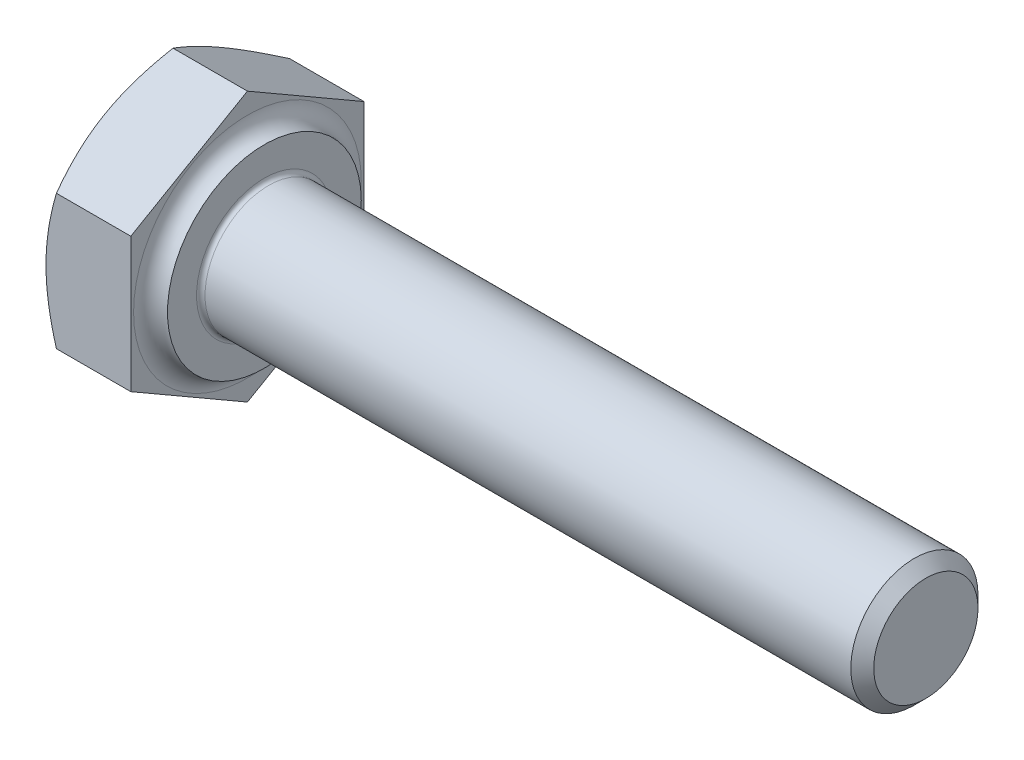
ISO-10303-21;
HEADER;
FILE_DESCRIPTION(('STEP AP214'),'2;1');
FILE_NAME('part.step','',(''),(''),'','','');
FILE_SCHEMA(('AUTOMOTIVE_DESIGN { 1 0 10303 214 1 1 1 1 }'));
ENDSEC;
DATA;
#1=APPLICATION_CONTEXT('core data for automotive mechanical design processes');
#2=APPLICATION_PROTOCOL_DEFINITION('international standard','automotive_design',2000,#1);
#3=PRODUCT_CONTEXT('',#1,'mechanical');
#4=PRODUCT('Part','Part','',(#3));
#5=PRODUCT_RELATED_PRODUCT_CATEGORY('part','',(#4));
#6=PRODUCT_DEFINITION_FORMATION('','',#4);
#7=PRODUCT_DEFINITION_CONTEXT('part definition',#1,'design');
#8=PRODUCT_DEFINITION('design','',#6,#7);
#9=PRODUCT_DEFINITION_SHAPE('','',#8);
#10=(LENGTH_UNIT() NAMED_UNIT(*) SI_UNIT(.MILLI.,.METRE.));
#11=(NAMED_UNIT(*) PLANE_ANGLE_UNIT() SI_UNIT($,.RADIAN.));
#12=(NAMED_UNIT(*) SI_UNIT($,.STERADIAN.) SOLID_ANGLE_UNIT());
#13=UNCERTAINTY_MEASURE_WITH_UNIT(LENGTH_MEASURE(1.E-05),#10,'distance_accuracy_value','');
#14=(GEOMETRIC_REPRESENTATION_CONTEXT(3) GLOBAL_UNCERTAINTY_ASSIGNED_CONTEXT((#13)) GLOBAL_UNIT_ASSIGNED_CONTEXT((#10,
#11,#12)) REPRESENTATION_CONTEXT('',''));
#15=CARTESIAN_POINT('',(0.,0.,0.));
#16=DIRECTION('',(0.,0.,1.));
#17=DIRECTION('',(1.,0.,0.));
#18=AXIS2_PLACEMENT_3D('',#15,#16,#17);
#19=CARTESIAN_POINT('',(-2.4,2.38156986040721,1.375));
#20=DIRECTION('',(0.,0.866025403784439,0.5));
#21=DIRECTION('',(0.,-0.5,0.866025403784439));
#22=AXIS2_PLACEMENT_3D('',#19,#20,#21);
#23=PLANE('',#22);
#24=CARTESIAN_POINT('',(-1.75390444775792,1.58689004084149,2.75142582323749));
#25=CARTESIAN_POINT('',(-2.,2.01280892325375,2.01371267899652));
#26=CARTESIAN_POINT('',(-2.,2.38156986040721,1.375));
#27=CARTESIAN_POINT('',(-2.,2.75033079756067,0.736287321003486));
#28=CARTESIAN_POINT('',(-1.75390444775792,3.17624967997292,-0.0014258232374917));
#29=(BOUNDED_CURVE() B_SPLINE_CURVE(2,(#24,#25,#26,#27,#28),.UNSPECIFIED.,.F.,
.F.) B_SPLINE_CURVE_WITH_KNOTS((3,2,3),(0.,1.6124120093164,3.22482401863281),
.UNSPECIFIED.) CURVE() GEOMETRIC_REPRESENTATION_ITEM() RATIONAL_B_SPLINE_CURVE((1.,
1.03802697460133,1.,1.03802697460134,1.)) REPRESENTATION_ITEM(''));
#30=CARTESIAN_POINT('',(-1.75437990693804,1.58771324027147,2.75));
#31=VERTEX_POINT('',#30);
#32=CARTESIAN_POINT('',(-2.,2.38156986040721,1.375));
#33=VERTEX_POINT('',#32);
#34=EDGE_CURVE('E154',#31,#33,#29,.T.);
#35=ORIENTED_EDGE('',*,*,#34,.F.);
#36=DIRECTION('',(-1.,0.,0.));
#37=VECTOR('',#36,1.);
#38=CARTESIAN_POINT('',(0.,1.58771324027147,2.75));
#39=LINE('',#38,#37);
#40=CARTESIAN_POINT('',(0.,1.58771324027147,2.75));
#41=VERTEX_POINT('',#40);
#42=EDGE_CURVE('E457',#41,#31,#39,.T.);
#43=ORIENTED_EDGE('',*,*,#42,.F.);
#44=DIRECTION('',(0.,-0.5,0.866025403784439));
#45=VECTOR('',#44,1.);
#46=CARTESIAN_POINT('',(0.,1.58771324027147,2.75));
#47=LINE('',#46,#45);
#48=CARTESIAN_POINT('',(0.,3.17542648054294,0.));
#49=VERTEX_POINT('',#48);
#50=EDGE_CURVE('E466',#49,#41,#47,.T.);
#51=ORIENTED_EDGE('',*,*,#50,.F.);
#52=DIRECTION('',(-1.,0.,0.));
#53=VECTOR('',#52,1.);
#54=CARTESIAN_POINT('',(0.,3.17542648054294,0.));
#55=LINE('',#54,#53);
#56=CARTESIAN_POINT('',(-1.75437990693804,3.17542648054294,0.));
#57=VERTEX_POINT('',#56);
#58=EDGE_CURVE('E303',#49,#57,#55,.T.);
#59=ORIENTED_EDGE('',*,*,#58,.T.);
#60=CARTESIAN_POINT('',(-1.75390444775792,1.58689004084149,2.75142582323749));
#61=CARTESIAN_POINT('',(-2.,2.01280892325375,2.01371267899652));
#62=CARTESIAN_POINT('',(-2.,2.38156986040721,1.375));
#63=CARTESIAN_POINT('',(-2.,2.75033079756067,0.736287321003486));
#64=CARTESIAN_POINT('',(-1.75390444775792,3.17624967997292,-0.0014258232374917));
#65=(BOUNDED_CURVE() B_SPLINE_CURVE(2,(#60,#61,#62,#63,#64),.UNSPECIFIED.,.F.,
.F.) B_SPLINE_CURVE_WITH_KNOTS((3,2,3),(0.,1.6124120093164,3.22482401863281),
.UNSPECIFIED.) CURVE() GEOMETRIC_REPRESENTATION_ITEM() RATIONAL_B_SPLINE_CURVE((1.,
1.03802697460133,1.,1.03802697460134,1.)) REPRESENTATION_ITEM(''));
#66=EDGE_CURVE('E103',#33,#57,#65,.T.);
#67=ORIENTED_EDGE('',*,*,#66,.F.);
#68=EDGE_LOOP('',(#35,#43,#51,#59,#67));
#69=FACE_BOUND('',#68,.T.);
#70=ADVANCED_FACE('F44',(#69),#23,.T.);
#71=CARTESIAN_POINT('',(-2.4,0.,2.75));
#72=DIRECTION('',(0.,0.,1.));
#73=DIRECTION('',(0.,-1.,0.));
#74=AXIS2_PLACEMENT_3D('',#71,#72,#73);
#75=PLANE('',#74);
#76=CARTESIAN_POINT('',(-1.75390444775792,-1.58935963913144,2.75));
#77=CARTESIAN_POINT('',(-2.,-0.737521874306931,2.75));
#78=CARTESIAN_POINT('',(-2.,0.,2.75));
#79=CARTESIAN_POINT('',(-2.,0.737521874306933,2.75));
#80=CARTESIAN_POINT('',(-1.75390444775792,1.58935963913144,2.75));
#81=(BOUNDED_CURVE() B_SPLINE_CURVE(2,(#76,#77,#78,#79,#80),.UNSPECIFIED.,.F.,
.F.) B_SPLINE_CURVE_WITH_KNOTS((3,2,3),(0.,1.6124120093164,3.22482401863281),
.UNSPECIFIED.) CURVE() GEOMETRIC_REPRESENTATION_ITEM() RATIONAL_B_SPLINE_CURVE((1.,
1.03802697460134,1.,1.03802697460135,1.)) REPRESENTATION_ITEM(''));
#82=CARTESIAN_POINT('',(-1.75437990693804,-1.58771324027147,2.75));
#83=VERTEX_POINT('',#82);
#84=CARTESIAN_POINT('',(-2.,0.,2.75));
#85=VERTEX_POINT('',#84);
#86=EDGE_CURVE('E137',#83,#85,#81,.T.);
#87=ORIENTED_EDGE('',*,*,#86,.F.);
#88=DIRECTION('',(-1.,0.,0.));
#89=VECTOR('',#88,1.);
#90=CARTESIAN_POINT('',(0.,-1.58771324027147,2.75));
#91=LINE('',#90,#89);
#92=CARTESIAN_POINT('',(0.,-1.58771324027147,2.75));
#93=VERTEX_POINT('',#92);
#94=EDGE_CURVE('E454',#93,#83,#91,.T.);
#95=ORIENTED_EDGE('',*,*,#94,.F.);
#96=DIRECTION('',(0.,-1.,0.));
#97=VECTOR('',#96,1.);
#98=CARTESIAN_POINT('',(0.,-1.58771324027147,2.75));
#99=LINE('',#98,#97);
#100=EDGE_CURVE('E459',#41,#93,#99,.T.);
#101=ORIENTED_EDGE('',*,*,#100,.F.);
#102=ORIENTED_EDGE('',*,*,#42,.T.);
#103=CARTESIAN_POINT('',(-1.75390444775792,-1.58935963913144,2.75));
#104=CARTESIAN_POINT('',(-2.,-0.737521874306931,2.75));
#105=CARTESIAN_POINT('',(-2.,0.,2.75));
#106=CARTESIAN_POINT('',(-2.,0.737521874306933,2.75));
#107=CARTESIAN_POINT('',(-1.75390444775792,1.58935963913144,2.75));
#108=(BOUNDED_CURVE() B_SPLINE_CURVE(2,(#103,#104,#105,#106,#107),.UNSPECIFIED.,.F.,
.F.) B_SPLINE_CURVE_WITH_KNOTS((3,2,3),(0.,1.6124120093164,3.22482401863281),
.UNSPECIFIED.) CURVE() GEOMETRIC_REPRESENTATION_ITEM() RATIONAL_B_SPLINE_CURVE((1.,
1.03802697460134,1.,1.03802697460135,1.)) REPRESENTATION_ITEM(''));
#109=EDGE_CURVE('E116',#85,#31,#108,.T.);
#110=ORIENTED_EDGE('',*,*,#109,.F.);
#111=EDGE_LOOP('',(#87,#95,#101,#102,#110));
#112=FACE_BOUND('',#111,.T.);
#113=ADVANCED_FACE('F210',(#112),#75,.T.);
#114=CARTESIAN_POINT('',(-2.4,-2.38156986040721,1.375));
#115=DIRECTION('',(0.,-0.866025403784439,0.5));
#116=DIRECTION('',(0.,-0.5,-0.866025403784439));
#117=AXIS2_PLACEMENT_3D('',#114,#115,#116);
#118=PLANE('',#117);
#119=CARTESIAN_POINT('',(-1.75390444775792,-3.17624967997292,-0.00142582323749051));
#120=CARTESIAN_POINT('',(-2.,-2.75033079756068,0.736287321003484));
#121=CARTESIAN_POINT('',(-2.,-2.38156986040721,1.375));
#122=CARTESIAN_POINT('',(-2.,-2.01280892325374,2.01371267899651));
#123=CARTESIAN_POINT('',(-1.75390444775792,-1.58689004084149,2.75142582323749));
#124=(BOUNDED_CURVE() B_SPLINE_CURVE(2,(#119,#120,#121,#122,#123),.UNSPECIFIED.,.F.,
.F.) B_SPLINE_CURVE_WITH_KNOTS((3,2,3),(0.,1.6124120093164,3.22482401863281),
.UNSPECIFIED.) CURVE() GEOMETRIC_REPRESENTATION_ITEM() RATIONAL_B_SPLINE_CURVE((1.,
1.03802697460134,1.,1.03802697460134,1.)) REPRESENTATION_ITEM(''));
#125=CARTESIAN_POINT('',(-1.75437990693813,-3.17542648054294,0.));
#126=VERTEX_POINT('',#125);
#127=CARTESIAN_POINT('',(-2.,-2.38156986040721,1.375));
#128=VERTEX_POINT('',#127);
#129=EDGE_CURVE('E178',#126,#128,#124,.T.);
#130=ORIENTED_EDGE('',*,*,#129,.F.);
#131=DIRECTION('',(-1.,0.,0.));
#132=VECTOR('',#131,1.);
#133=CARTESIAN_POINT('',(0.,-3.17542648054294,0.));
#134=LINE('',#133,#132);
#135=CARTESIAN_POINT('',(0.,-3.17542648054294,0.));
#136=VERTEX_POINT('',#135);
#137=EDGE_CURVE('E453',#136,#126,#134,.T.);
#138=ORIENTED_EDGE('',*,*,#137,.F.);
#139=DIRECTION('',(0.,-0.5,-0.866025403784439));
#140=VECTOR('',#139,1.);
#141=CARTESIAN_POINT('',(0.,-3.17542648054294,0.));
#142=LINE('',#141,#140);
#143=EDGE_CURVE('E294',#93,#136,#142,.T.);
#144=ORIENTED_EDGE('',*,*,#143,.F.);
#145=ORIENTED_EDGE('',*,*,#94,.T.);
#146=CARTESIAN_POINT('',(-1.75390444775792,-3.17624967997292,-0.00142582323749051));
#147=CARTESIAN_POINT('',(-2.,-2.75033079756068,0.736287321003484));
#148=CARTESIAN_POINT('',(-2.,-2.38156986040721,1.375));
#149=CARTESIAN_POINT('',(-2.,-2.01280892325374,2.01371267899651));
#150=CARTESIAN_POINT('',(-1.75390444775792,-1.58689004084149,2.75142582323749));
#151=(BOUNDED_CURVE() B_SPLINE_CURVE(2,(#146,#147,#148,#149,#150),.UNSPECIFIED.,.F.,
.F.) B_SPLINE_CURVE_WITH_KNOTS((3,2,3),(0.,1.6124120093164,3.22482401863281),
.UNSPECIFIED.) CURVE() GEOMETRIC_REPRESENTATION_ITEM() RATIONAL_B_SPLINE_CURVE((1.,
1.03802697460134,1.,1.03802697460134,1.)) REPRESENTATION_ITEM(''));
#152=EDGE_CURVE('E331',#128,#83,#151,.T.);
#153=ORIENTED_EDGE('',*,*,#152,.F.);
#154=EDGE_LOOP('',(#130,#138,#144,#145,#153));
#155=FACE_BOUND('',#154,.T.);
#156=ADVANCED_FACE('F216',(#155),#118,.T.);
#157=CARTESIAN_POINT('',(-2.4,2.38156986040721,-1.375));
#158=DIRECTION('',(0.,0.866025403784439,-0.5));
#159=DIRECTION('',(0.,0.5,0.866025403784439));
#160=AXIS2_PLACEMENT_3D('',#157,#158,#159);
#161=PLANE('',#160);
#162=CARTESIAN_POINT('',(-1.75390444775792,3.17624967997292,0.00142582323748956));
#163=CARTESIAN_POINT('',(-2.,2.75033079756067,-0.736287321003486));
#164=CARTESIAN_POINT('',(-2.,2.38156986040721,-1.375));
#165=CARTESIAN_POINT('',(-2.,2.01280892325374,-2.01371267899651));
#166=CARTESIAN_POINT('',(-1.75390444775792,1.58689004084149,-2.75142582323749));
#167=(BOUNDED_CURVE() B_SPLINE_CURVE(2,(#162,#163,#164,#165,#166),.UNSPECIFIED.,.F.,
.F.) B_SPLINE_CURVE_WITH_KNOTS((3,2,3),(0.,1.6124120093164,3.22482401863281),
.UNSPECIFIED.) CURVE() GEOMETRIC_REPRESENTATION_ITEM() RATIONAL_B_SPLINE_CURVE((1.,
1.03802697460134,1.,1.03802697460134,1.)) REPRESENTATION_ITEM(''));
#168=CARTESIAN_POINT('',(-2.,2.38156986040721,-1.375));
#169=VERTEX_POINT('',#168);
#170=EDGE_CURVE('E93',#57,#169,#167,.T.);
#171=ORIENTED_EDGE('',*,*,#170,.F.);
#172=ORIENTED_EDGE('',*,*,#58,.F.);
#173=DIRECTION('',(0.,0.5,0.866025403784439));
#174=VECTOR('',#173,1.);
#175=CARTESIAN_POINT('',(0.,3.17542648054294,0.));
#176=LINE('',#175,#174);
#177=CARTESIAN_POINT('',(0.,1.58771324027147,-2.75));
#178=VERTEX_POINT('',#177);
#179=EDGE_CURVE('E288',#178,#49,#176,.T.);
#180=ORIENTED_EDGE('',*,*,#179,.F.);
#181=DIRECTION('',(-1.,0.,0.));
#182=VECTOR('',#181,1.);
#183=CARTESIAN_POINT('',(0.,1.58771324027147,-2.75));
#184=LINE('',#183,#182);
#185=CARTESIAN_POINT('',(-1.75437990693804,1.58771324027147,-2.75));
#186=VERTEX_POINT('',#185);
#187=EDGE_CURVE('E98',#178,#186,#184,.T.);
#188=ORIENTED_EDGE('',*,*,#187,.T.);
#189=CARTESIAN_POINT('',(-1.75390444775792,3.17624967997292,0.00142582323748956));
#190=CARTESIAN_POINT('',(-2.,2.75033079756067,-0.736287321003486));
#191=CARTESIAN_POINT('',(-2.,2.38156986040721,-1.375));
#192=CARTESIAN_POINT('',(-2.,2.01280892325374,-2.01371267899651));
#193=CARTESIAN_POINT('',(-1.75390444775792,1.58689004084149,-2.75142582323749));
#194=(BOUNDED_CURVE() B_SPLINE_CURVE(2,(#189,#190,#191,#192,#193),.UNSPECIFIED.,.F.,
.F.) B_SPLINE_CURVE_WITH_KNOTS((3,2,3),(0.,1.6124120093164,3.22482401863281),
.UNSPECIFIED.) CURVE() GEOMETRIC_REPRESENTATION_ITEM() RATIONAL_B_SPLINE_CURVE((1.,
1.03802697460134,1.,1.03802697460134,1.)) REPRESENTATION_ITEM(''));
#195=EDGE_CURVE('E89',#169,#186,#194,.T.);
#196=ORIENTED_EDGE('',*,*,#195,.F.);
#197=EDGE_LOOP('',(#171,#172,#180,#188,#196));
#198=FACE_BOUND('',#197,.T.);
#199=ADVANCED_FACE('F90',(#198),#161,.T.);
#200=CARTESIAN_POINT('',(-2.4,0.,-2.75));
#201=DIRECTION('',(0.,0.,-1.));
#202=DIRECTION('',(0.,1.,0.));
#203=AXIS2_PLACEMENT_3D('',#200,#201,#202);
#204=PLANE('',#203);
#205=CARTESIAN_POINT('',(-1.75390444775792,1.58935963913144,-2.75));
#206=CARTESIAN_POINT('',(-2.,0.73752187430693,-2.75));
#207=CARTESIAN_POINT('',(-2.,0.,-2.75));
#208=CARTESIAN_POINT('',(-2.,-0.73752187430693,-2.75));
#209=CARTESIAN_POINT('',(-1.75390444775792,-1.58935963913144,-2.75));
#210=(BOUNDED_CURVE() B_SPLINE_CURVE(2,(#205,#206,#207,#208,#209),.UNSPECIFIED.,.F.,
.F.) B_SPLINE_CURVE_WITH_KNOTS((3,2,3),(0.,1.6124120093164,3.22482401863281),
.UNSPECIFIED.) CURVE() GEOMETRIC_REPRESENTATION_ITEM() RATIONAL_B_SPLINE_CURVE((1.,
1.03802697460134,1.,1.03802697460134,1.)) REPRESENTATION_ITEM(''));
#211=CARTESIAN_POINT('',(-2.,0.,-2.75));
#212=VERTEX_POINT('',#211);
#213=EDGE_CURVE('E104',#186,#212,#210,.T.);
#214=ORIENTED_EDGE('',*,*,#213,.F.);
#215=ORIENTED_EDGE('',*,*,#187,.F.);
#216=DIRECTION('',(0.,1.,0.));
#217=VECTOR('',#216,1.);
#218=CARTESIAN_POINT('',(0.,1.58771324027147,-2.75));
#219=LINE('',#218,#217);
#220=CARTESIAN_POINT('',(0.,-1.58771324027147,-2.75));
#221=VERTEX_POINT('',#220);
#222=EDGE_CURVE('E283',#221,#178,#219,.T.);
#223=ORIENTED_EDGE('',*,*,#222,.F.);
#224=DIRECTION('',(-1.,0.,0.));
#225=VECTOR('',#224,1.);
#226=CARTESIAN_POINT('',(0.,-1.58771324027147,-2.75));
#227=LINE('',#226,#225);
#228=CARTESIAN_POINT('',(-1.75437990693804,-1.58771324027147,-2.75));
#229=VERTEX_POINT('',#228);
#230=EDGE_CURVE('E286',#221,#229,#227,.T.);
#231=ORIENTED_EDGE('',*,*,#230,.T.);
#232=CARTESIAN_POINT('',(-1.75390444775792,1.58935963913144,-2.75));
#233=CARTESIAN_POINT('',(-2.,0.73752187430693,-2.75));
#234=CARTESIAN_POINT('',(-2.,0.,-2.75));
#235=CARTESIAN_POINT('',(-2.,-0.73752187430693,-2.75));
#236=CARTESIAN_POINT('',(-1.75390444775792,-1.58935963913144,-2.75));
#237=(BOUNDED_CURVE() B_SPLINE_CURVE(2,(#232,#233,#234,#235,#236),.UNSPECIFIED.,.F.,
.F.) B_SPLINE_CURVE_WITH_KNOTS((3,2,3),(0.,1.6124120093164,3.22482401863281),
.UNSPECIFIED.) CURVE() GEOMETRIC_REPRESENTATION_ITEM() RATIONAL_B_SPLINE_CURVE((1.,
1.03802697460134,1.,1.03802697460134,1.)) REPRESENTATION_ITEM(''));
#238=EDGE_CURVE('E122',#212,#229,#237,.T.);
#239=ORIENTED_EDGE('',*,*,#238,.F.);
#240=EDGE_LOOP('',(#214,#215,#223,#231,#239));
#241=FACE_BOUND('',#240,.T.);
#242=ADVANCED_FACE('F228',(#241),#204,.T.);
#243=CARTESIAN_POINT('',(-2.4,-2.38156986040721,-1.375));
#244=DIRECTION('',(0.,-0.866025403784439,-0.5));
#245=DIRECTION('',(0.,0.5,-0.866025403784439));
#246=AXIS2_PLACEMENT_3D('',#243,#244,#245);
#247=PLANE('',#246);
#248=CARTESIAN_POINT('',(-1.75390444775792,-1.58689004084149,-2.75142582323749));
#249=CARTESIAN_POINT('',(-2.,-2.01280892325374,-2.01371267899652));
#250=CARTESIAN_POINT('',(-2.,-2.38156986040721,-1.375));
#251=CARTESIAN_POINT('',(-2.,-2.75033079756067,-0.736287321003484));
#252=CARTESIAN_POINT('',(-1.75390444775792,-3.17624967997292,0.00142582323749194));
#253=(BOUNDED_CURVE() B_SPLINE_CURVE(2,(#248,#249,#250,#251,#252),.UNSPECIFIED.,.F.,
.F.) B_SPLINE_CURVE_WITH_KNOTS((3,2,3),(0.,1.6124120093164,3.22482401863281),
.UNSPECIFIED.) CURVE() GEOMETRIC_REPRESENTATION_ITEM() RATIONAL_B_SPLINE_CURVE((1.,
1.03802697460134,1.,1.03802697460135,1.)) REPRESENTATION_ITEM(''));
#254=CARTESIAN_POINT('',(-2.,-2.38156986040721,-1.375));
#255=VERTEX_POINT('',#254);
#256=EDGE_CURVE('E129',#229,#255,#253,.T.);
#257=ORIENTED_EDGE('',*,*,#256,.F.);
#258=ORIENTED_EDGE('',*,*,#230,.F.);
#259=DIRECTION('',(0.,0.5,-0.866025403784439));
#260=VECTOR('',#259,1.);
#261=CARTESIAN_POINT('',(0.,-1.58771324027147,-2.75));
#262=LINE('',#261,#260);
#263=EDGE_CURVE('E289',#136,#221,#262,.T.);
#264=ORIENTED_EDGE('',*,*,#263,.F.);
#265=ORIENTED_EDGE('',*,*,#137,.T.);
#266=CARTESIAN_POINT('',(-1.75390444775792,-1.58689004084149,-2.75142582323749));
#267=CARTESIAN_POINT('',(-2.,-2.01280892325374,-2.01371267899652));
#268=CARTESIAN_POINT('',(-2.,-2.38156986040721,-1.375));
#269=CARTESIAN_POINT('',(-2.,-2.75033079756067,-0.736287321003484));
#270=CARTESIAN_POINT('',(-1.75390444775792,-3.17624967997292,0.00142582323749194));
#271=(BOUNDED_CURVE() B_SPLINE_CURVE(2,(#266,#267,#268,#269,#270),.UNSPECIFIED.,.F.,
.F.) B_SPLINE_CURVE_WITH_KNOTS((3,2,3),(0.,1.6124120093164,3.22482401863281),
.UNSPECIFIED.) CURVE() GEOMETRIC_REPRESENTATION_ITEM() RATIONAL_B_SPLINE_CURVE((1.,
1.03802697460134,1.,1.03802697460135,1.)) REPRESENTATION_ITEM(''));
#272=EDGE_CURVE('E184',#255,#126,#271,.T.);
#273=ORIENTED_EDGE('',*,*,#272,.F.);
#274=EDGE_LOOP('',(#257,#258,#264,#265,#273));
#275=FACE_BOUND('',#274,.T.);
#276=ADVANCED_FACE('F224',(#275),#247,.T.);
#277=CARTESIAN_POINT('',(-1.87695222387896,0.,0.));
#278=DIRECTION('',(1.,0.,0.));
#279=DIRECTION('',(0.,1.,0.));
#280=AXIS2_PLACEMENT_3D('',#277,#278,#279);
#281=CONICAL_SURFACE('',#280,2.963125,1.0471975511966);
#282=ORIENTED_EDGE('',*,*,#86,.T.);
#283=CARTESIAN_POINT('',(-2.,0.,0.));
#284=DIRECTION('',(1.,0.,0.));
#285=DIRECTION('',(0.,1.,0.));
#286=AXIS2_PLACEMENT_3D('',#283,#284,#285);
#287=CIRCLE('',#286,2.75);
#288=EDGE_CURVE('E312',#85,#128,#287,.T.);
#289=ORIENTED_EDGE('',*,*,#288,.T.);
#290=ORIENTED_EDGE('',*,*,#152,.T.);
#291=EDGE_LOOP('',(#282,#289,#290));
#292=FACE_BOUND('',#291,.T.);
#293=ADVANCED_FACE('F227',(#292),#281,.T.);
#294=CARTESIAN_POINT('',(-1.87695222387896,0.,0.));
#295=DIRECTION('',(1.,0.,0.));
#296=DIRECTION('',(0.,1.,0.));
#297=AXIS2_PLACEMENT_3D('',#294,#295,#296);
#298=CONICAL_SURFACE('',#297,2.963125,1.0471975511966);
#299=ORIENTED_EDGE('',*,*,#34,.T.);
#300=CARTESIAN_POINT('',(-2.,0.,0.));
#301=DIRECTION('',(1.,0.,0.));
#302=DIRECTION('',(0.,1.,0.));
#303=AXIS2_PLACEMENT_3D('',#300,#301,#302);
#304=CIRCLE('',#303,2.75);
#305=EDGE_CURVE('E61',#33,#85,#304,.T.);
#306=ORIENTED_EDGE('',*,*,#305,.T.);
#307=ORIENTED_EDGE('',*,*,#109,.T.);
#308=EDGE_LOOP('',(#299,#306,#307));
#309=FACE_BOUND('',#308,.T.);
#310=ADVANCED_FACE('F222',(#309),#298,.T.);
#311=CARTESIAN_POINT('',(-1.87695222387896,0.,0.));
#312=DIRECTION('',(1.,0.,0.));
#313=DIRECTION('',(0.,1.,0.));
#314=AXIS2_PLACEMENT_3D('',#311,#312,#313);
#315=CONICAL_SURFACE('',#314,2.963125,1.0471975511966);
#316=ORIENTED_EDGE('',*,*,#170,.T.);
#317=CARTESIAN_POINT('',(-2.,0.,0.));
#318=DIRECTION('',(1.,0.,0.));
#319=DIRECTION('',(0.,1.,0.));
#320=AXIS2_PLACEMENT_3D('',#317,#318,#319);
#321=CIRCLE('',#320,2.75);
#322=EDGE_CURVE('E83',#169,#33,#321,.T.);
#323=ORIENTED_EDGE('',*,*,#322,.T.);
#324=ORIENTED_EDGE('',*,*,#66,.T.);
#325=EDGE_LOOP('',(#316,#323,#324));
#326=FACE_BOUND('',#325,.T.);
#327=ADVANCED_FACE('F113',(#326),#315,.T.);
#328=CARTESIAN_POINT('',(-1.87695222387896,0.,0.));
#329=DIRECTION('',(1.,0.,0.));
#330=DIRECTION('',(0.,1.,0.));
#331=AXIS2_PLACEMENT_3D('',#328,#329,#330);
#332=CONICAL_SURFACE('',#331,2.963125,1.0471975511966);
#333=ORIENTED_EDGE('',*,*,#195,.T.);
#334=ORIENTED_EDGE('',*,*,#213,.T.);
#335=CARTESIAN_POINT('',(-2.,0.,0.));
#336=DIRECTION('',(1.,0.,0.));
#337=DIRECTION('',(0.,1.,0.));
#338=AXIS2_PLACEMENT_3D('',#335,#336,#337);
#339=CIRCLE('',#338,2.75);
#340=EDGE_CURVE('E110',#212,#169,#339,.T.);
#341=ORIENTED_EDGE('',*,*,#340,.T.);
#342=EDGE_LOOP('',(#333,#334,#341));
#343=FACE_BOUND('',#342,.T.);
#344=ADVANCED_FACE('F118',(#343),#332,.T.);
#345=CARTESIAN_POINT('',(-1.87695222387896,0.,0.));
#346=DIRECTION('',(1.,0.,0.));
#347=DIRECTION('',(0.,1.,0.));
#348=AXIS2_PLACEMENT_3D('',#345,#346,#347);
#349=CONICAL_SURFACE('',#348,2.963125,1.0471975511966);
#350=ORIENTED_EDGE('',*,*,#238,.T.);
#351=ORIENTED_EDGE('',*,*,#256,.T.);
#352=CARTESIAN_POINT('',(-2.,0.,0.));
#353=DIRECTION('',(1.,0.,0.));
#354=DIRECTION('',(0.,1.,0.));
#355=AXIS2_PLACEMENT_3D('',#352,#353,#354);
#356=CIRCLE('',#355,2.75);
#357=EDGE_CURVE('E306',#255,#212,#356,.T.);
#358=ORIENTED_EDGE('',*,*,#357,.T.);
#359=EDGE_LOOP('',(#350,#351,#358));
#360=FACE_BOUND('',#359,.T.);
#361=ADVANCED_FACE('F231',(#360),#349,.T.);
#362=CARTESIAN_POINT('',(-1.87695222387896,0.,0.));
#363=DIRECTION('',(1.,0.,0.));
#364=DIRECTION('',(0.,1.,0.));
#365=AXIS2_PLACEMENT_3D('',#362,#363,#364);
#366=CONICAL_SURFACE('',#365,2.963125,1.0471975511966);
#367=ORIENTED_EDGE('',*,*,#272,.T.);
#368=ORIENTED_EDGE('',*,*,#129,.T.);
#369=CARTESIAN_POINT('',(-2.,0.,0.));
#370=DIRECTION('',(1.,0.,0.));
#371=DIRECTION('',(0.,1.,0.));
#372=AXIS2_PLACEMENT_3D('',#369,#370,#371);
#373=CIRCLE('',#372,2.75);
#374=EDGE_CURVE('E185',#128,#255,#373,.T.);
#375=ORIENTED_EDGE('',*,*,#374,.T.);
#376=EDGE_LOOP('',(#367,#368,#375));
#377=FACE_BOUND('',#376,.T.);
#378=ADVANCED_FACE('F242',(#377),#366,.T.);
#379=CARTESIAN_POINT('',(-2.,1.375,0.));
#380=DIRECTION('',(-1.,0.,0.));
#381=DIRECTION('',(0.,-1.,0.));
#382=AXIS2_PLACEMENT_3D('',#379,#380,#381);
#383=PLANE('',#382);
#384=ORIENTED_EDGE('',*,*,#322,.F.);
#385=ORIENTED_EDGE('',*,*,#340,.F.);
#386=ORIENTED_EDGE('',*,*,#357,.F.);
#387=ORIENTED_EDGE('',*,*,#374,.F.);
#388=ORIENTED_EDGE('',*,*,#288,.F.);
#389=ORIENTED_EDGE('',*,*,#305,.F.);
#390=EDGE_LOOP('',(#384,#385,#386,#387,#388,#389));
#391=FACE_BOUND('',#390,.T.);
#392=ADVANCED_FACE('F108',(#391),#383,.T.);
#393=CARTESIAN_POINT('',(0.,0.,0.));
#394=DIRECTION('',(-1.,0.,0.));
#395=DIRECTION('',(0.,-1.,0.));
#396=AXIS2_PLACEMENT_3D('',#393,#394,#395);
#397=PLANE('',#396);
#398=CARTESIAN_POINT('',(0.,0.,0.));
#399=DIRECTION('',(1.,0.,0.));
#400=DIRECTION('',(0.,0.,-1.));
#401=AXIS2_PLACEMENT_3D('',#398,#399,#400);
#402=CIRCLE('',#401,2.685);
#403=CARTESIAN_POINT('',(0.,0.,-2.685));
#404=VERTEX_POINT('',#403);
#405=EDGE_CURVE('E638',#404,#404,#402,.T.);
#406=ORIENTED_EDGE('',*,*,#405,.F.);
#407=EDGE_LOOP('',(#406));
#408=FACE_BOUND('',#407,.T.);
#409=ORIENTED_EDGE('',*,*,#263,.T.);
#410=ORIENTED_EDGE('',*,*,#222,.T.);
#411=ORIENTED_EDGE('',*,*,#179,.T.);
#412=ORIENTED_EDGE('',*,*,#50,.T.);
#413=ORIENTED_EDGE('',*,*,#100,.T.);
#414=ORIENTED_EDGE('',*,*,#143,.T.);
#415=EDGE_LOOP('',(#409,#410,#411,#412,#413,#414));
#416=FACE_BOUND('',#415,.T.);
#417=ADVANCED_FACE('F292',(#408,#416),#397,.F.);
#418=CARTESIAN_POINT('',(0.4,0.,0.));
#419=DIRECTION('',(1.,0.,0.));
#420=DIRECTION('',(0.,0.,-1.));
#421=AXIS2_PLACEMENT_3D('',#418,#419,#420);
#422=TOROIDAL_SURFACE('',#421,2.685,0.4);
#423=ORIENTED_EDGE('',*,*,#405,.T.);
#424=EDGE_LOOP('',(#423));
#425=FACE_BOUND('',#424,.T.);
#426=CARTESIAN_POINT('',(0.4,0.,0.));
#427=DIRECTION('',(1.,0.,0.));
#428=DIRECTION('',(0.,0.,-1.));
#429=AXIS2_PLACEMENT_3D('',#426,#427,#428);
#430=CIRCLE('',#429,2.285);
#431=CARTESIAN_POINT('',(0.4,0.,-2.285));
#432=VERTEX_POINT('',#431);
#433=EDGE_CURVE('E297',#432,#432,#430,.T.);
#434=ORIENTED_EDGE('',*,*,#433,.F.);
#435=EDGE_LOOP('',(#434));
#436=FACE_BOUND('',#435,.T.);
#437=ADVANCED_FACE('F583',(#425,#436),#422,.F.);
#438=CARTESIAN_POINT('',(0.4,1.5,0.));
#439=DIRECTION('',(1.,0.,0.));
#440=DIRECTION('',(0.,0.,-1.));
#441=AXIS2_PLACEMENT_3D('',#438,#439,#440);
#442=PLANE('',#441);
#443=CARTESIAN_POINT('',(0.4,0.,0.));
#444=DIRECTION('',(1.,0.,0.));
#445=DIRECTION('',(0.,0.,-1.));
#446=AXIS2_PLACEMENT_3D('',#443,#444,#445);
#447=CIRCLE('',#446,1.6);
#448=CARTESIAN_POINT('',(0.4,0.,-1.6));
#449=VERTEX_POINT('',#448);
#450=EDGE_CURVE('E12',#449,#449,#447,.F.);
#451=ORIENTED_EDGE('',*,*,#450,.T.);
#452=EDGE_LOOP('',(#451));
#453=FACE_BOUND('',#452,.T.);
#454=ORIENTED_EDGE('',*,*,#433,.T.);
#455=EDGE_LOOP('',(#454));
#456=FACE_BOUND('',#455,.T.);
#457=ADVANCED_FACE('F593',(#453,#456),#442,.T.);
#458=CARTESIAN_POINT('',(0.,0.,0.));
#459=DIRECTION('',(1.,0.,0.));
#460=DIRECTION('',(0.,0.,-1.));
#461=AXIS2_PLACEMENT_3D('',#458,#459,#460);
#462=CYLINDRICAL_SURFACE('',#461,1.5);
#463=CARTESIAN_POINT('',(0.5,0.,0.));
#464=DIRECTION('',(1.,0.,0.));
#465=DIRECTION('',(0.,0.,-1.));
#466=AXIS2_PLACEMENT_3D('',#463,#464,#465);
#467=CIRCLE('',#466,1.5);
#468=CARTESIAN_POINT('',(0.5,0.,-1.5));
#469=VERTEX_POINT('',#468);
#470=EDGE_CURVE('E53',#469,#469,#467,.T.);
#471=ORIENTED_EDGE('',*,*,#470,.T.);
#472=EDGE_LOOP('',(#471));
#473=FACE_BOUND('',#472,.T.);
#474=CARTESIAN_POINT('',(15.729375,0.,0.));
#475=DIRECTION('',(1.,0.,0.));
#476=DIRECTION('',(0.,0.,-1.));
#477=AXIS2_PLACEMENT_3D('',#474,#475,#476);
#478=CIRCLE('',#477,1.5);
#479=CARTESIAN_POINT('',(15.729375,0.,-1.5));
#480=VERTEX_POINT('',#479);
#481=EDGE_CURVE('E192',#480,#480,#478,.F.);
#482=ORIENTED_EDGE('',*,*,#481,.T.);
#483=EDGE_LOOP('',(#482));
#484=FACE_BOUND('',#483,.T.);
#485=ADVANCED_FACE('F197',(#473,#484),#462,.T.);
#486=CARTESIAN_POINT('',(16.,0.,0.));
#487=DIRECTION('',(1.,0.,0.));
#488=DIRECTION('',(0.,0.,-1.));
#489=AXIS2_PLACEMENT_3D('',#486,#487,#488);
#490=PLANE('',#489);
#491=CARTESIAN_POINT('',(16.,0.,0.));
#492=DIRECTION('',(1.,0.,0.));
#493=DIRECTION('',(0.,0.,-1.));
#494=AXIS2_PLACEMENT_3D('',#491,#492,#493);
#495=CIRCLE('',#494,1.229375);
#496=CARTESIAN_POINT('',(16.,0.,-1.229375));
#497=VERTEX_POINT('',#496);
#498=EDGE_CURVE('E186',#497,#497,#495,.T.);
#499=ORIENTED_EDGE('',*,*,#498,.T.);
#500=EDGE_LOOP('',(#499));
#501=FACE_BOUND('',#500,.T.);
#502=ADVANCED_FACE('F206',(#501),#490,.T.);
#503=CARTESIAN_POINT('',(16.,0.,0.));
#504=DIRECTION('',(-1.,0.,0.));
#505=DIRECTION('',(0.,0.,1.));
#506=AXIS2_PLACEMENT_3D('',#503,#504,#505);
#507=CONICAL_SURFACE('',#506,1.229375,0.785398163397449);
#508=ORIENTED_EDGE('',*,*,#481,.F.);
#509=EDGE_LOOP('',(#508));
#510=FACE_BOUND('',#509,.T.);
#511=ORIENTED_EDGE('',*,*,#498,.F.);
#512=EDGE_LOOP('',(#511));
#513=FACE_BOUND('',#512,.T.);
#514=ADVANCED_FACE('F201',(#510,#513),#507,.T.);
#515=CARTESIAN_POINT('',(0.5,0.,0.));
#516=DIRECTION('',(1.,0.,0.));
#517=DIRECTION('',(0.,0.,-1.));
#518=AXIS2_PLACEMENT_3D('',#515,#516,#517);
#519=TOROIDAL_SURFACE('',#518,1.6,0.1);
#520=ORIENTED_EDGE('',*,*,#450,.F.);
#521=EDGE_LOOP('',(#520));
#522=FACE_BOUND('',#521,.T.);
#523=ORIENTED_EDGE('',*,*,#470,.F.);
#524=EDGE_LOOP('',(#523));
#525=FACE_BOUND('',#524,.T.);
#526=ADVANCED_FACE('F46',(#522,#525),#519,.F.);
#527=CLOSED_SHELL('',(#70,#113,#156,#199,#242,#276,#293,#310,#327,#344,#361,#378,#392,#417,#437,
#457,#485,#502,#514,#526));
#528=MANIFOLD_SOLID_BREP('B2',#527);
#529=ADVANCED_BREP_SHAPE_REPRESENTATION('',(#18,#528),#14);
#530=SHAPE_DEFINITION_REPRESENTATION(#9,#529);
ENDSEC;
END-ISO-10303-21;
